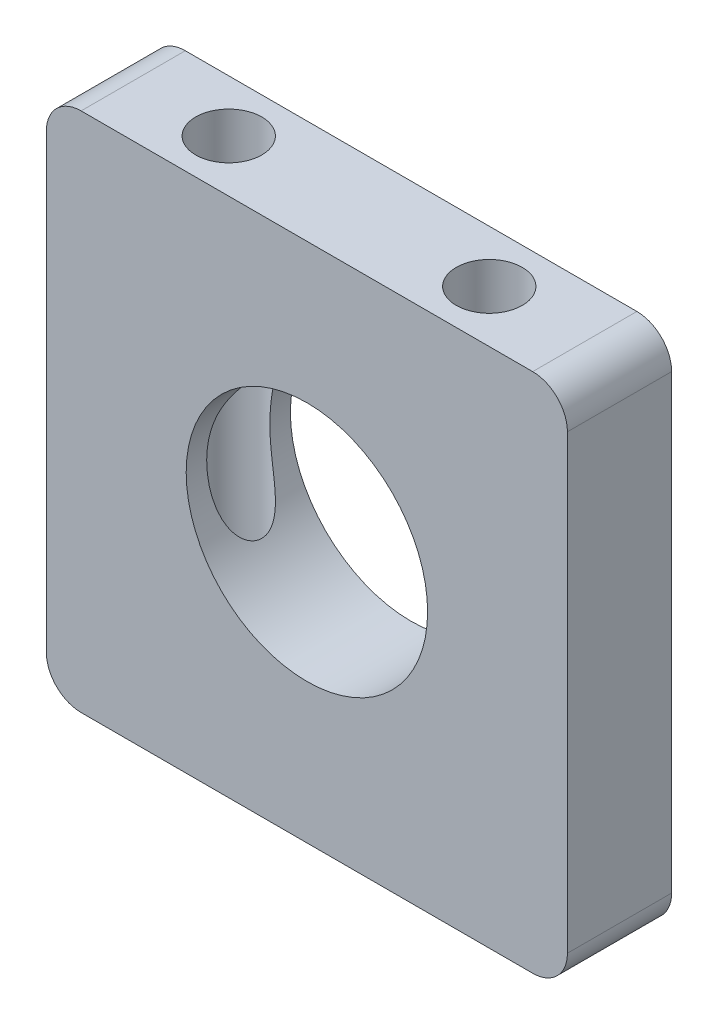
ISO-10303-21;
HEADER;
FILE_DESCRIPTION(('STEP AP214'),'2;1');
FILE_NAME('part.step','',(''),(''),'','','');
FILE_SCHEMA(('AUTOMOTIVE_DESIGN { 1 0 10303 214 1 1 1 1 }'));
ENDSEC;
DATA;
#1=APPLICATION_CONTEXT('core data for automotive mechanical design processes');
#2=APPLICATION_PROTOCOL_DEFINITION('international standard','automotive_design',2000,#1);
#3=PRODUCT_CONTEXT('',#1,'mechanical');
#4=PRODUCT('Part','Part','',(#3));
#5=PRODUCT_RELATED_PRODUCT_CATEGORY('part','',(#4));
#6=PRODUCT_DEFINITION_FORMATION('','',#4);
#7=PRODUCT_DEFINITION_CONTEXT('part definition',#1,'design');
#8=PRODUCT_DEFINITION('design','',#6,#7);
#9=PRODUCT_DEFINITION_SHAPE('','',#8);
#10=(LENGTH_UNIT() NAMED_UNIT(*) SI_UNIT(.MILLI.,.METRE.));
#11=(NAMED_UNIT(*) PLANE_ANGLE_UNIT() SI_UNIT($,.RADIAN.));
#12=(NAMED_UNIT(*) SI_UNIT($,.STERADIAN.) SOLID_ANGLE_UNIT());
#13=UNCERTAINTY_MEASURE_WITH_UNIT(LENGTH_MEASURE(1.E-05),#10,'distance_accuracy_value','');
#14=(GEOMETRIC_REPRESENTATION_CONTEXT(3) GLOBAL_UNCERTAINTY_ASSIGNED_CONTEXT((#13)) GLOBAL_UNIT_ASSIGNED_CONTEXT((#10,
#11,#12)) REPRESENTATION_CONTEXT('',''));
#15=CARTESIAN_POINT('',(0.,0.,0.));
#16=DIRECTION('',(0.,0.,1.));
#17=DIRECTION('',(1.,0.,0.));
#18=AXIS2_PLACEMENT_3D('',#15,#16,#17);
#19=CARTESIAN_POINT('',(0.,0.,7.62));
#20=DIRECTION('',(0.,0.,1.));
#21=DIRECTION('',(1.,0.,0.));
#22=AXIS2_PLACEMENT_3D('',#19,#20,#21);
#23=PLANE('',#22);
#24=DIRECTION('',(1.,0.,0.));
#25=VECTOR('',#24,1.);
#26=CARTESIAN_POINT('',(19.05,-19.05,7.62));
#27=LINE('',#26,#25);
#28=CARTESIAN_POINT('',(-16.51,-19.05,7.62));
#29=VERTEX_POINT('',#28);
#30=CARTESIAN_POINT('',(16.51,-19.05,7.62));
#31=VERTEX_POINT('',#30);
#32=EDGE_CURVE('E174',#29,#31,#27,.T.);
#33=ORIENTED_EDGE('',*,*,#32,.T.);
#34=CARTESIAN_POINT('',(16.51,-16.51,7.62));
#35=DIRECTION('',(0.,0.,1.));
#36=DIRECTION('',(1.,0.,0.));
#37=AXIS2_PLACEMENT_3D('',#34,#35,#36);
#38=CIRCLE('',#37,2.54);
#39=CARTESIAN_POINT('',(19.05,-16.51,7.62));
#40=VERTEX_POINT('',#39);
#41=EDGE_CURVE('E152',#31,#40,#38,.T.);
#42=ORIENTED_EDGE('',*,*,#41,.T.);
#43=DIRECTION('',(0.,1.,0.));
#44=VECTOR('',#43,1.);
#45=CARTESIAN_POINT('',(19.05,-19.05,7.62));
#46=LINE('',#45,#44);
#47=CARTESIAN_POINT('',(19.05,16.51,7.62));
#48=VERTEX_POINT('',#47);
#49=EDGE_CURVE('E122',#40,#48,#46,.T.);
#50=ORIENTED_EDGE('',*,*,#49,.T.);
#51=CARTESIAN_POINT('',(16.51,16.51,7.62));
#52=DIRECTION('',(0.,0.,1.));
#53=DIRECTION('',(1.,0.,0.));
#54=AXIS2_PLACEMENT_3D('',#51,#52,#53);
#55=CIRCLE('',#54,2.54);
#56=CARTESIAN_POINT('',(16.51,19.05,7.62));
#57=VERTEX_POINT('',#56);
#58=EDGE_CURVE('E58',#48,#57,#55,.T.);
#59=ORIENTED_EDGE('',*,*,#58,.T.);
#60=DIRECTION('',(-1.,0.,0.));
#61=VECTOR('',#60,1.);
#62=CARTESIAN_POINT('',(19.05,19.05,7.62));
#63=LINE('',#62,#61);
#64=CARTESIAN_POINT('',(-16.51,19.05,7.62));
#65=VERTEX_POINT('',#64);
#66=EDGE_CURVE('E138',#57,#65,#63,.T.);
#67=ORIENTED_EDGE('',*,*,#66,.T.);
#68=CARTESIAN_POINT('',(-16.51,16.51,7.62));
#69=DIRECTION('',(0.,0.,1.));
#70=DIRECTION('',(1.,0.,0.));
#71=AXIS2_PLACEMENT_3D('',#68,#69,#70);
#72=CIRCLE('',#71,2.54);
#73=CARTESIAN_POINT('',(-19.05,16.51,7.62));
#74=VERTEX_POINT('',#73);
#75=EDGE_CURVE('E148',#65,#74,#72,.T.);
#76=ORIENTED_EDGE('',*,*,#75,.T.);
#77=DIRECTION('',(0.,-1.,0.));
#78=VECTOR('',#77,1.);
#79=CARTESIAN_POINT('',(-19.05,-19.05,7.62));
#80=LINE('',#79,#78);
#81=CARTESIAN_POINT('',(-19.05,-16.51,7.62));
#82=VERTEX_POINT('',#81);
#83=EDGE_CURVE('E132',#74,#82,#80,.T.);
#84=ORIENTED_EDGE('',*,*,#83,.T.);
#85=CARTESIAN_POINT('',(-16.51,-16.51,7.62));
#86=DIRECTION('',(0.,0.,1.));
#87=DIRECTION('',(1.,0.,0.));
#88=AXIS2_PLACEMENT_3D('',#85,#86,#87);
#89=CIRCLE('',#88,2.54);
#90=EDGE_CURVE('E150',#82,#29,#89,.T.);
#91=ORIENTED_EDGE('',*,*,#90,.T.);
#92=EDGE_LOOP('',(#33,#42,#50,#59,#67,#76,#84,#91));
#93=FACE_BOUND('',#92,.T.);
#94=CARTESIAN_POINT('',(0.,0.,7.62));
#95=DIRECTION('',(0.,0.,1.));
#96=DIRECTION('',(1.,0.,0.));
#97=AXIS2_PLACEMENT_3D('',#94,#95,#96);
#98=CIRCLE('',#97,8.8265);
#99=CARTESIAN_POINT('',(8.8265,0.,7.62));
#100=VERTEX_POINT('',#99);
#101=EDGE_CURVE('E183',#100,#100,#98,.T.);
#102=ORIENTED_EDGE('',*,*,#101,.F.);
#103=EDGE_LOOP('',(#102));
#104=FACE_BOUND('',#103,.T.);
#105=ADVANCED_FACE('F38',(#93,#104),#23,.T.);
#106=CARTESIAN_POINT('',(0.,0.,0.));
#107=DIRECTION('',(0.,0.,1.));
#108=DIRECTION('',(1.,0.,0.));
#109=AXIS2_PLACEMENT_3D('',#106,#107,#108);
#110=PLANE('',#109);
#111=DIRECTION('',(0.,1.,0.));
#112=VECTOR('',#111,1.);
#113=CARTESIAN_POINT('',(19.05,-19.05,0.));
#114=LINE('',#113,#112);
#115=CARTESIAN_POINT('',(19.05,-16.51,0.));
#116=VERTEX_POINT('',#115);
#117=CARTESIAN_POINT('',(19.05,16.51,0.));
#118=VERTEX_POINT('',#117);
#119=EDGE_CURVE('E120',#116,#118,#114,.T.);
#120=ORIENTED_EDGE('',*,*,#119,.F.);
#121=CARTESIAN_POINT('',(16.51,-16.51,0.));
#122=DIRECTION('',(0.,0.,1.));
#123=DIRECTION('',(1.,0.,0.));
#124=AXIS2_PLACEMENT_3D('',#121,#122,#123);
#125=CIRCLE('',#124,2.54);
#126=CARTESIAN_POINT('',(16.51,-19.05,0.));
#127=VERTEX_POINT('',#126);
#128=EDGE_CURVE('E103',#116,#127,#125,.F.);
#129=ORIENTED_EDGE('',*,*,#128,.T.);
#130=DIRECTION('',(1.,0.,0.));
#131=VECTOR('',#130,1.);
#132=CARTESIAN_POINT('',(19.05,-19.05,0.));
#133=LINE('',#132,#131);
#134=CARTESIAN_POINT('',(-16.51,-19.05,0.));
#135=VERTEX_POINT('',#134);
#136=EDGE_CURVE('E130',#135,#127,#133,.T.);
#137=ORIENTED_EDGE('',*,*,#136,.F.);
#138=CARTESIAN_POINT('',(-16.51,-16.51,0.));
#139=DIRECTION('',(0.,0.,1.));
#140=DIRECTION('',(1.,0.,0.));
#141=AXIS2_PLACEMENT_3D('',#138,#139,#140);
#142=CIRCLE('',#141,2.54);
#143=CARTESIAN_POINT('',(-19.05,-16.51,0.));
#144=VERTEX_POINT('',#143);
#145=EDGE_CURVE('E114',#135,#144,#142,.F.);
#146=ORIENTED_EDGE('',*,*,#145,.T.);
#147=DIRECTION('',(0.,-1.,0.));
#148=VECTOR('',#147,1.);
#149=CARTESIAN_POINT('',(-19.05,-19.05,0.));
#150=LINE('',#149,#148);
#151=CARTESIAN_POINT('',(-19.05,16.51,0.));
#152=VERTEX_POINT('',#151);
#153=EDGE_CURVE('E134',#152,#144,#150,.T.);
#154=ORIENTED_EDGE('',*,*,#153,.F.);
#155=CARTESIAN_POINT('',(-16.51,16.51,0.));
#156=DIRECTION('',(0.,0.,1.));
#157=DIRECTION('',(1.,0.,0.));
#158=AXIS2_PLACEMENT_3D('',#155,#156,#157);
#159=CIRCLE('',#158,2.54);
#160=CARTESIAN_POINT('',(-16.51,19.05,0.));
#161=VERTEX_POINT('',#160);
#162=EDGE_CURVE('E141',#152,#161,#159,.F.);
#163=ORIENTED_EDGE('',*,*,#162,.T.);
#164=DIRECTION('',(-1.,0.,0.));
#165=VECTOR('',#164,1.);
#166=CARTESIAN_POINT('',(19.05,19.05,0.));
#167=LINE('',#166,#165);
#168=CARTESIAN_POINT('',(16.51,19.05,0.));
#169=VERTEX_POINT('',#168);
#170=EDGE_CURVE('E129',#169,#161,#167,.T.);
#171=ORIENTED_EDGE('',*,*,#170,.F.);
#172=CARTESIAN_POINT('',(16.51,16.51,0.));
#173=DIRECTION('',(0.,0.,1.));
#174=DIRECTION('',(1.,0.,0.));
#175=AXIS2_PLACEMENT_3D('',#172,#173,#174);
#176=CIRCLE('',#175,2.54);
#177=EDGE_CURVE('E123',#169,#118,#176,.F.);
#178=ORIENTED_EDGE('',*,*,#177,.T.);
#179=EDGE_LOOP('',(#120,#129,#137,#146,#154,#163,#171,#178));
#180=FACE_BOUND('',#179,.T.);
#181=CARTESIAN_POINT('',(0.,0.,0.));
#182=DIRECTION('',(0.,0.,1.));
#183=DIRECTION('',(1.,0.,0.));
#184=AXIS2_PLACEMENT_3D('',#181,#182,#183);
#185=CIRCLE('',#184,8.8265);
#186=CARTESIAN_POINT('',(8.8265,0.,0.));
#187=VERTEX_POINT('',#186);
#188=EDGE_CURVE('E179',#187,#187,#185,.T.);
#189=ORIENTED_EDGE('',*,*,#188,.T.);
#190=EDGE_LOOP('',(#189));
#191=FACE_BOUND('',#190,.T.);
#192=ADVANCED_FACE('F126',(#180,#191),#110,.F.);
#193=CARTESIAN_POINT('',(-19.05,-19.05,7.62));
#194=DIRECTION('',(1.,0.,0.));
#195=DIRECTION('',(0.,0.,-1.));
#196=AXIS2_PLACEMENT_3D('',#193,#194,#195);
#197=PLANE('',#196);
#198=ORIENTED_EDGE('',*,*,#153,.T.);
#199=DIRECTION('',(0.,0.,-1.));
#200=VECTOR('',#199,1.);
#201=CARTESIAN_POINT('',(-19.05,-16.51,7.62));
#202=LINE('',#201,#200);
#203=EDGE_CURVE('E157',#144,#82,#202,.F.);
#204=ORIENTED_EDGE('',*,*,#203,.T.);
#205=ORIENTED_EDGE('',*,*,#83,.F.);
#206=DIRECTION('',(0.,0.,-1.));
#207=VECTOR('',#206,1.);
#208=CARTESIAN_POINT('',(-19.05,16.51,7.62));
#209=LINE('',#208,#207);
#210=EDGE_CURVE('E154',#74,#152,#209,.T.);
#211=ORIENTED_EDGE('',*,*,#210,.T.);
#212=EDGE_LOOP('',(#198,#204,#205,#211));
#213=FACE_BOUND('',#212,.T.);
#214=ADVANCED_FACE('F170',(#213),#197,.F.);
#215=CARTESIAN_POINT('',(19.05,-19.05,7.62));
#216=DIRECTION('',(0.,1.,0.));
#217=DIRECTION('',(-1.,0.,0.));
#218=AXIS2_PLACEMENT_3D('',#215,#216,#217);
#219=PLANE('',#218);
#220=CARTESIAN_POINT('',(9.525,-19.05,3.81));
#221=DIRECTION('',(0.,-1.,0.));
#222=DIRECTION('',(1.,0.,0.));
#223=AXIS2_PLACEMENT_3D('',#220,#221,#222);
#224=CIRCLE('',#223,2.413);
#225=CARTESIAN_POINT('',(11.938,-19.05,3.81));
#226=VERTEX_POINT('',#225);
#227=EDGE_CURVE('E188',#226,#226,#224,.T.);
#228=ORIENTED_EDGE('',*,*,#227,.F.);
#229=EDGE_LOOP('',(#228));
#230=FACE_BOUND('',#229,.T.);
#231=CARTESIAN_POINT('',(-9.525,-19.05,3.81));
#232=DIRECTION('',(0.,-1.,0.));
#233=DIRECTION('',(1.,0.,0.));
#234=AXIS2_PLACEMENT_3D('',#231,#232,#233);
#235=CIRCLE('',#234,2.413);
#236=CARTESIAN_POINT('',(-7.112,-19.05,3.81));
#237=VERTEX_POINT('',#236);
#238=EDGE_CURVE('E190',#237,#237,#235,.T.);
#239=ORIENTED_EDGE('',*,*,#238,.F.);
#240=EDGE_LOOP('',(#239));
#241=FACE_BOUND('',#240,.T.);
#242=ORIENTED_EDGE('',*,*,#136,.T.);
#243=DIRECTION('',(0.,0.,-1.));
#244=VECTOR('',#243,1.);
#245=CARTESIAN_POINT('',(16.51,-19.05,7.62));
#246=LINE('',#245,#244);
#247=EDGE_CURVE('E108',#127,#31,#246,.F.);
#248=ORIENTED_EDGE('',*,*,#247,.T.);
#249=ORIENTED_EDGE('',*,*,#32,.F.);
#250=DIRECTION('',(0.,0.,-1.));
#251=VECTOR('',#250,1.);
#252=CARTESIAN_POINT('',(-16.51,-19.05,7.62));
#253=LINE('',#252,#251);
#254=EDGE_CURVE('E113',#29,#135,#253,.T.);
#255=ORIENTED_EDGE('',*,*,#254,.T.);
#256=EDGE_LOOP('',(#242,#248,#249,#255));
#257=FACE_BOUND('',#256,.T.);
#258=ADVANCED_FACE('F243',(#230,#241,#257),#219,.F.);
#259=CARTESIAN_POINT('',(19.05,-19.05,7.62));
#260=DIRECTION('',(-1.,0.,0.));
#261=DIRECTION('',(0.,0.,1.));
#262=AXIS2_PLACEMENT_3D('',#259,#260,#261);
#263=PLANE('',#262);
#264=ORIENTED_EDGE('',*,*,#49,.F.);
#265=DIRECTION('',(0.,0.,-1.));
#266=VECTOR('',#265,1.);
#267=CARTESIAN_POINT('',(19.05,-16.51,7.62));
#268=LINE('',#267,#266);
#269=EDGE_CURVE('E107',#40,#116,#268,.T.);
#270=ORIENTED_EDGE('',*,*,#269,.T.);
#271=ORIENTED_EDGE('',*,*,#119,.T.);
#272=DIRECTION('',(0.,0.,-1.));
#273=VECTOR('',#272,1.);
#274=CARTESIAN_POINT('',(19.05,16.51,7.62));
#275=LINE('',#274,#273);
#276=EDGE_CURVE('E124',#118,#48,#275,.F.);
#277=ORIENTED_EDGE('',*,*,#276,.T.);
#278=EDGE_LOOP('',(#264,#270,#271,#277));
#279=FACE_BOUND('',#278,.T.);
#280=ADVANCED_FACE('F119',(#279),#263,.F.);
#281=CARTESIAN_POINT('',(19.05,19.05,7.62));
#282=DIRECTION('',(0.,-1.,0.));
#283=DIRECTION('',(1.,0.,0.));
#284=AXIS2_PLACEMENT_3D('',#281,#282,#283);
#285=PLANE('',#284);
#286=CARTESIAN_POINT('',(-9.525,19.05,3.81));
#287=DIRECTION('',(0.,1.,0.));
#288=DIRECTION('',(-1.,0.,0.));
#289=AXIS2_PLACEMENT_3D('',#286,#287,#288);
#290=CIRCLE('',#289,2.413);
#291=CARTESIAN_POINT('',(-11.938,19.05,3.81));
#292=VERTEX_POINT('',#291);
#293=EDGE_CURVE('E193',#292,#292,#290,.T.);
#294=ORIENTED_EDGE('',*,*,#293,.F.);
#295=EDGE_LOOP('',(#294));
#296=FACE_BOUND('',#295,.T.);
#297=CARTESIAN_POINT('',(9.525,19.05,3.81));
#298=DIRECTION('',(0.,1.,0.));
#299=DIRECTION('',(-1.,0.,0.));
#300=AXIS2_PLACEMENT_3D('',#297,#298,#299);
#301=CIRCLE('',#300,2.413);
#302=CARTESIAN_POINT('',(7.112,19.05,3.81));
#303=VERTEX_POINT('',#302);
#304=EDGE_CURVE('E196',#303,#303,#301,.T.);
#305=ORIENTED_EDGE('',*,*,#304,.F.);
#306=EDGE_LOOP('',(#305));
#307=FACE_BOUND('',#306,.T.);
#308=ORIENTED_EDGE('',*,*,#170,.T.);
#309=DIRECTION('',(0.,0.,-1.));
#310=VECTOR('',#309,1.);
#311=CARTESIAN_POINT('',(-16.51,19.05,7.62));
#312=LINE('',#311,#310);
#313=EDGE_CURVE('E11',#161,#65,#312,.F.);
#314=ORIENTED_EDGE('',*,*,#313,.T.);
#315=ORIENTED_EDGE('',*,*,#66,.F.);
#316=DIRECTION('',(0.,0.,-1.));
#317=VECTOR('',#316,1.);
#318=CARTESIAN_POINT('',(16.51,19.05,7.62));
#319=LINE('',#318,#317);
#320=EDGE_CURVE('E46',#57,#169,#319,.T.);
#321=ORIENTED_EDGE('',*,*,#320,.T.);
#322=EDGE_LOOP('',(#308,#314,#315,#321));
#323=FACE_BOUND('',#322,.T.);
#324=ADVANCED_FACE('F160',(#296,#307,#323),#285,.F.);
#325=CARTESIAN_POINT('',(0.,0.,7.62));
#326=DIRECTION('',(0.,0.,-1.));
#327=DIRECTION('',(-1.,0.,0.));
#328=AXIS2_PLACEMENT_3D('',#325,#326,#327);
#329=CYLINDRICAL_SURFACE('',#328,8.8265);
#330=CARTESIAN_POINT('',(7.112,-5.22748106165865,3.81));
#331=CARTESIAN_POINT('',(7.11200801079814,-5.22747300955538,3.9030672297396));
#332=CARTESIAN_POINT('',(7.11745006339892,-5.22009103076612,3.99630652009354));
#333=CARTESIAN_POINT('',(7.13865510247261,-5.19105080802399,4.17943494363403));
#334=CARTESIAN_POINT('',(7.15444600180276,-5.16935395299357,4.26931431946948));
#335=CARTESIAN_POINT('',(7.1945975987547,-5.11331871029749,4.44214586214466));
#336=CARTESIAN_POINT('',(7.21889217918834,-5.07907776138608,4.52514553144723));
#337=CARTESIAN_POINT('',(7.27402184084216,-4.99980373509525,4.68332649330547));
#338=CARTESIAN_POINT('',(7.30485708926352,-4.95477038182233,4.75850758591912));
#339=CARTESIAN_POINT('',(7.38367609311725,-4.83685306073568,4.92759491391936));
#340=CARTESIAN_POINT('',(7.43371240449293,-4.75990014444413,5.01769206491304));
#341=CARTESIAN_POINT('',(7.5378564826724,-4.59320277096938,5.18236139419303));
#342=CARTESIAN_POINT('',(7.59197271071986,-4.50343136507206,5.25690002932834));
#343=CARTESIAN_POINT('',(7.68860972081786,-4.33584429807193,5.3767618008045));
#344=CARTESIAN_POINT('',(7.73099177109867,-4.25990125841613,5.42488214535389));
#345=CARTESIAN_POINT('',(7.81515362907748,-4.10345764776672,5.51374391777611));
#346=CARTESIAN_POINT('',(7.85693308347699,-4.02295452943619,5.55448116689365));
#347=CARTESIAN_POINT('',(7.93913525581443,-3.85820236859984,5.6295340904718));
#348=CARTESIAN_POINT('',(7.97955587172541,-3.77394795243486,5.66384016053239));
#349=CARTESIAN_POINT('',(8.05843125325966,-3.60245889566426,5.72684338987061));
#350=CARTESIAN_POINT('',(8.09688528316701,-3.51522315979069,5.75553846120012));
#351=CARTESIAN_POINT('',(8.19854142820529,-3.27390914216966,5.82725464496647));
#352=CARTESIAN_POINT('',(8.25937954792695,-3.11740415006639,5.86549667619405));
#353=CARTESIAN_POINT('',(8.37261243954521,-2.79911945958914,5.93104653927953));
#354=CARTESIAN_POINT('',(8.42500121656131,-2.63733611317506,5.95834662795413));
#355=CARTESIAN_POINT('',(8.52066835130171,-2.30965205873508,6.0047017757217));
#356=CARTESIAN_POINT('',(8.5639306405223,-2.14374465422905,6.02374235397012));
#357=CARTESIAN_POINT('',(8.6408166293954,-1.80911258941824,6.05555337047227));
#358=CARTESIAN_POINT('',(8.67443817393846,-1.64038730810677,6.06832240722837));
#359=CARTESIAN_POINT('',(8.74213279935605,-1.23976907421071,6.09285847623068));
#360=CARTESIAN_POINT('',(8.77199925862041,-1.00703159884214,6.10260484605242));
#361=CARTESIAN_POINT('',(8.81311048854332,-0.539682404066879,6.11569620335264));
#362=CARTESIAN_POINT('',(8.82434809903276,-0.305069998811009,6.11903872953183));
#363=CARTESIAN_POINT('',(8.82809095702108,0.16434198856395,6.12017109552819));
#364=CARTESIAN_POINT('',(8.82059420036036,0.39914158802246,6.11796034126803));
#365=CARTESIAN_POINT('',(8.7869265538363,0.867200353736336,6.10742016643486));
#366=CARTESIAN_POINT('',(8.76076269780756,1.10046006682457,6.09909305049553));
#367=CARTESIAN_POINT('',(8.69939553960829,1.50244405713452,6.07752788236942));
#368=CARTESIAN_POINT('',(8.66841184401029,1.67192356778129,6.06617062459568));
#369=CARTESIAN_POINT('',(8.59670762484014,2.00830179657323,6.03763105323173));
#370=CARTESIAN_POINT('',(8.55598911150654,2.17520103997756,6.02044994196084));
#371=CARTESIAN_POINT('',(8.46528080925571,2.50505317847193,5.97842323126903));
#372=CARTESIAN_POINT('',(8.41531473521015,2.66801498883356,5.95359713126773));
#373=CARTESIAN_POINT('',(8.30671486836645,2.98902796171199,5.89379329659095));
#374=CARTESIAN_POINT('',(8.24808692195613,3.1470823501189,5.8588223939954));
#375=CARTESIAN_POINT('',(8.12051925553573,3.46330214880813,5.7737099204325));
#376=CARTESIAN_POINT('',(8.05124640930059,3.62118485353996,5.72298499152574));
#377=CARTESIAN_POINT('',(7.94291524089051,3.85024386856684,5.63257165522813));
#378=CARTESIAN_POINT('',(7.90606375060776,3.92531020314923,5.60004203502554));
#379=CARTESIAN_POINT('',(7.83135995174388,4.07230845583826,5.52953262172186));
#380=CARTESIAN_POINT('',(7.79350786129736,4.14424104820425,5.49155400865767));
#381=CARTESIAN_POINT('',(7.69593815245045,4.32378357590118,5.38631984851432));
#382=CARTESIAN_POINT('',(7.63590201297114,4.4286929219027,5.31461542380668));
#383=CARTESIAN_POINT('',(7.51823630741705,4.62561549821409,5.15363631198799));
#384=CARTESIAN_POINT('',(7.46060207748125,4.71765462479875,5.0643978021338));
#385=CARTESIAN_POINT('',(7.3683075419553,4.86006002745423,4.89520237819679));
#386=CARTESIAN_POINT('',(7.3318068986622,4.91479871341166,4.81995658230632));
#387=CARTESIAN_POINT('',(7.26496636333918,5.01307212302397,4.65989492597317));
#388=CARTESIAN_POINT('',(7.23462404805187,5.05661125543217,4.57508285030986));
#389=CARTESIAN_POINT('',(7.18243182875338,5.13048399052183,4.39625179024768));
#390=CARTESIAN_POINT('',(7.1606712967228,5.16067899721653,4.3021480537806));
#391=CARTESIAN_POINT('',(7.12851440028009,5.20501350463715,4.10837282822847));
#392=CARTESIAN_POINT('',(7.11810477579197,5.21917174019378,4.00870797905444));
#393=CARTESIAN_POINT('',(7.11052885982475,5.22948371264671,3.82325216677152));
#394=CARTESIAN_POINT('',(7.11158823401923,5.22804953849425,3.73765805104472));
#395=CARTESIAN_POINT('',(7.12264962396727,5.21296964557485,3.56815889111249));
#396=CARTESIAN_POINT('',(7.13265018881398,5.19932590808051,3.48425357512048));
#397=CARTESIAN_POINT('',(7.16002983666261,5.16154806225807,3.32445317928279));
#398=CARTESIAN_POINT('',(7.17703796389667,5.13794007581426,3.24836693970078));
#399=CARTESIAN_POINT('',(7.21711776266923,5.0814870080408,3.10144011927015));
#400=CARTESIAN_POINT('',(7.24019130196137,5.04863908118988,3.03060116287213));
#401=CARTESIAN_POINT('',(7.30125708183351,4.96010689965093,2.86774712695388));
#402=CARTESIAN_POINT('',(7.34151592997976,4.90055270308401,2.77868611103498));
#403=CARTESIAN_POINT('',(7.42759319637689,4.76908144895804,2.61325430134165));
#404=CARTESIAN_POINT('',(7.47342293325163,4.69713909406129,2.53691011634232));
#405=CARTESIAN_POINT('',(7.55508110704635,4.56423405940081,2.41506559409516));
#406=CARTESIAN_POINT('',(7.59033201354374,4.50543192720093,2.36675931029214));
#407=CARTESIAN_POINT('',(7.6613325571251,4.38361396297353,2.2761743547652));
#408=CARTESIAN_POINT('',(7.69708242637281,4.32059611391491,2.23389859911847));
#409=CARTESIAN_POINT('',(7.80405590183839,4.12620663931901,2.11520722928784));
#410=CARTESIAN_POINT('',(7.87494238389388,3.98959675814357,2.04701283681415));
#411=CARTESIAN_POINT('',(8.00128391053103,3.72884798090472,1.93737970521777));
#412=CARTESIAN_POINT('',(8.05743138950969,3.60604159620615,1.893435347286));
#413=CARTESIAN_POINT('',(8.16506300191149,3.35521437529458,1.8156200055499));
#414=CARTESIAN_POINT('',(8.21654388624672,3.22718999463251,1.78175600323039));
#415=CARTESIAN_POINT('',(8.31404018169202,2.96701693593067,1.72207838210069));
#416=CARTESIAN_POINT('',(8.36004566528364,2.83486129898889,1.69627925214377));
#417=CARTESIAN_POINT('',(8.44599357746109,2.56749503698585,1.65114352627329));
#418=CARTESIAN_POINT('',(8.48593418868845,2.4322835101064,1.63180886538092));
#419=CARTESIAN_POINT('',(8.58039765918767,2.08160646898726,1.58865721841114));
#420=CARTESIAN_POINT('',(8.6302242535648,1.86440150892112,1.56858497299655));
#421=CARTESIAN_POINT('',(8.71337438311501,1.42619044304737,1.53716311036081));
#422=CARTESIAN_POINT('',(8.74668938900417,1.20518243358587,1.52581799959188));
#423=CARTESIAN_POINT('',(8.79650942077131,0.760672252957275,1.50944360252643));
#424=CARTESIAN_POINT('',(8.81298566904717,0.537166469690534,1.50442512510267));
#425=CARTESIAN_POINT('',(8.82888603106338,0.0895487112811985,1.49957544945694));
#426=CARTESIAN_POINT('',(8.82831399028827,-0.134563115755585,1.49974308143441));
#427=CARTESIAN_POINT('',(8.8099387553858,-0.586874939764453,1.50536301166863));
#428=CARTESIAN_POINT('',(8.79176267168413,-0.81505836565834,1.51092967604014));
#429=CARTESIAN_POINT('',(8.73776126727406,-1.2692159566235,1.52884887053123));
#430=CARTESIAN_POINT('',(8.7019282561096,-1.49518911523819,1.54120435778551));
#431=CARTESIAN_POINT('',(8.63534935239369,-1.83051372935022,1.56687002276559));
#432=CARTESIAN_POINT('',(8.61107961894315,-1.94146374495876,1.57658738697392));
#433=CARTESIAN_POINT('',(8.55835374385892,-2.16206729586719,1.59889406528424));
#434=CARTESIAN_POINT('',(8.52989823501917,-2.27172102443382,1.61148294543652));
#435=CARTESIAN_POINT('',(8.46894581033314,-2.48934084627888,1.64010369810335));
#436=CARTESIAN_POINT('',(8.4364525189571,-2.59730835654801,1.65613249208238));
#437=CARTESIAN_POINT('',(8.36758412738009,-2.81127384142546,1.69234264985676));
#438=CARTESIAN_POINT('',(8.33121005126755,-2.91727232700753,1.71252291943019));
#439=CARTESIAN_POINT('',(8.26299732839584,-3.10445975958024,1.75302765462885));
#440=CARTESIAN_POINT('',(8.23185168468993,-3.1861077432458,1.77239883988701));
#441=CARTESIAN_POINT('',(8.16749176476715,-3.34764641707366,1.8146994937066));
#442=CARTESIAN_POINT('',(8.13427771440964,-3.4275372978179,1.83762857417062));
#443=CARTESIAN_POINT('',(8.06595712751096,-3.58536510289984,1.88761667755942));
#444=CARTESIAN_POINT('',(8.0308476418086,-3.66329868870159,1.91468226380045));
#445=CARTESIAN_POINT('',(7.9591036222997,-3.81666572107733,1.973511506775));
#446=CARTESIAN_POINT('',(7.92246908331402,-3.89209915915918,2.00527517946432));
#447=CARTESIAN_POINT('',(7.84760121525959,-4.04095151295898,2.0746206355606));
#448=CARTESIAN_POINT('',(7.80935292387184,-4.1143291147714,2.11227562667819));
#449=CARTESIAN_POINT('',(7.73233310260597,-4.25731376189064,2.19381292849721));
#450=CARTESIAN_POINT('',(7.6935614392074,-4.32691982140809,2.23769685654569));
#451=CARTESIAN_POINT('',(7.61646667073028,-4.46122266591766,2.33223981287751));
#452=CARTESIAN_POINT('',(7.57814244536536,-4.5259364313798,2.38287354522346));
#453=CARTESIAN_POINT('',(7.50291727164956,-4.64957700473765,2.49162303373021));
#454=CARTESIAN_POINT('',(7.46601496433771,-4.70850942571472,2.54973140350246));
#455=CARTESIAN_POINT('',(7.39156253884922,-4.82463477371872,2.67988892437756));
#456=CARTESIAN_POINT('',(7.3542886592708,-4.88112096206216,2.75274013950501));
#457=CARTESIAN_POINT('',(7.28530333055292,-4.98350043962659,2.90803113687255));
#458=CARTESIAN_POINT('',(7.25359281621395,-5.02939194905453,2.99047252666654));
#459=CARTESIAN_POINT('',(7.19798862958908,-5.10866524247668,3.16500614687056));
#460=CARTESIAN_POINT('',(7.17418392256116,-5.14190522737732,3.25719377118488));
#461=CARTESIAN_POINT('',(7.14660515971969,-5.18009416706716,3.39991545905339));
#462=CARTESIAN_POINT('',(7.13877032364369,-5.19087422183113,3.44818447048929));
#463=CARTESIAN_POINT('',(7.12600246937045,-5.20838854830386,3.54581505687472));
#464=CARTESIAN_POINT('',(7.12106714479755,-5.21512603570707,3.59517573095543));
#465=CARTESIAN_POINT('',(7.11577918030006,-5.22233647376985,3.67223088477446));
#466=CARTESIAN_POINT('',(7.11436405607167,-5.22426366923365,3.69972759803358));
#467=CARTESIAN_POINT('',(7.11247322877179,-5.22683722434251,3.75481115659372));
#468=CARTESIAN_POINT('',(7.11199762414802,-5.22748344976096,3.78239801103686));
#469=CARTESIAN_POINT('',(7.112,-5.22748106165865,3.81));
#470=B_SPLINE_CURVE_WITH_KNOTS('',3,(#330,#331,#332,#333,#334,#335,#336,#337,#338,#339,#340,
#341,#342,#343,#344,#345,#346,#347,#348,#349,#350,#351,#352,#353,#354,#355,#356,#357,#358,#359,
#360,#361,#362,#363,#364,#365,#366,#367,#368,#369,#370,#371,#372,#373,#374,#375,#376,#377,#378,
#379,#380,#381,#382,#383,#384,#385,#386,#387,#388,#389,#390,#391,#392,#393,#394,#395,#396,#397,
#398,#399,#400,#401,#402,#403,#404,#405,#406,#407,#408,#409,#410,#411,#412,#413,#414,#415,#416,
#417,#418,#419,#420,#421,#422,#423,#424,#425,#426,#427,#428,#429,#430,#431,#432,#433,#434,#435,
#436,#437,#438,#439,#440,#441,#442,#443,#444,#445,#446,#447,#448,#449,#450,#451,#452,#453,#454,
#455,#456,#457,#458,#459,#460,#461,#462,#463,#464,#465,#466,#467,#468,#469),.UNSPECIFIED.,.T.,
.F.,(4,2,2,2,2,2,2,2,2,2,2,2,2,2,2,2,2,2,2,2,2,2,2,2,2,2,2,2,2,2,2,2,2,2,2,2,2,2,2,2,2,2,2,2,2,
2,2,2,2,2,2,2,2,2,2,2,2,2,2,2,2,2,2,2,2,2,2,2,2,4),(0.,0.279069458955362,0.55889473769484,
0.836590973608862,1.11429430921603,1.49801833719957,1.88256129402263,2.180339380468,
2.47828548343557,2.7766730584672,3.07517145816856,3.59098224272549,4.10715740456639,
4.62423391952498,5.14142593274866,5.84506427804118,6.5489730105396,7.25295704880151,
7.95667596317752,8.47431526420308,8.99184776497035,9.50807102267847,10.0239474305448,
10.5618235034241,10.8308182548553,11.0997548403163,11.5200227593813,11.9394324962845,
12.2382274495442,12.5369046002334,12.838614900099,13.1399723645834,13.3954681187199,
13.6509224205167,13.8943066937968,14.1377660016255,14.4792251471773,14.8213900253384,
15.0726546358045,15.32404033701,15.8272366218506,16.2527167240454,16.6784908246235,
17.1050255061983,17.5316877491021,18.2019803435139,18.8726188266689,19.5444015306281,
20.2160327055725,20.9022087250199,21.588683872225,21.9305522625059,22.272369023084,
22.6138811425417,22.9553033632757,23.2237294256681,23.4921262285371,23.7609533996614,
24.0297814838067,24.3022632648958,24.5748159258992,24.8463744542888,25.1176666627344,
25.4149327259917,25.7122486904984,26.0128051947085,26.1628166743044,26.3127086672526,
26.3954667457759,26.4782334956575),.UNSPECIFIED.);
#471=CARTESIAN_POINT('',(7.112,-5.22748106165865,3.81));
#472=VERTEX_POINT('',#471);
#473=EDGE_CURVE('E199',#472,#472,#470,.T.);
#474=ORIENTED_EDGE('',*,*,#473,.F.);
#475=EDGE_LOOP('',(#474));
#476=FACE_BOUND('',#475,.T.);
#477=CARTESIAN_POINT('',(-8.8265,0.,6.1196897518931));
#478=CARTESIAN_POINT('',(-8.82650092603533,-0.204315636438204,6.1196866895291));
#479=CARTESIAN_POINT('',(-8.81940289139985,-0.408619186177959,6.1175779911619));
#480=CARTESIAN_POINT('',(-8.79105616660927,-0.816183150386737,6.10872181238477));
#481=CARTESIAN_POINT('',(-8.76980559431162,-1.01944342248693,6.10197371497843));
#482=CARTESIAN_POINT('',(-8.71336848012611,-1.4233077795708,6.08259992639713));
#483=CARTESIAN_POINT('',(-8.6782111586325,-1.62391652830382,6.06998654945617));
#484=CARTESIAN_POINT('',(-8.5942792993427,-2.02155771082447,6.03674230499844));
#485=CARTESIAN_POINT('',(-8.5455111801531,-2.21859178383315,6.01611521481109));
#486=CARTESIAN_POINT('',(-8.45857516287716,-2.52449307224613,5.97483683757558));
#487=CARTESIAN_POINT('',(-8.42475730743351,-2.63512249488426,5.95794798820488));
#488=CARTESIAN_POINT('',(-8.35305709543693,-2.85426297779103,5.91968616821279));
#489=CARTESIAN_POINT('',(-8.31517554573674,-2.96277445354275,5.89831408694174));
#490=CARTESIAN_POINT('',(-8.23563630915024,-3.17717961339194,5.85016439979778));
#491=CARTESIAN_POINT('',(-8.19397909233373,-3.28307362128007,5.82338746631995));
#492=CARTESIAN_POINT('',(-8.10731424545524,-3.49160308850892,5.76333507045181));
#493=CARTESIAN_POINT('',(-8.06230742804973,-3.59423932966189,5.73006118114708));
#494=CARTESIAN_POINT('',(-7.98107182151055,-3.77048325831746,5.66495233766081));
#495=CARTESIAN_POINT('',(-7.94543033186359,-3.84498370207006,5.63480272292887));
#496=CARTESIAN_POINT('',(-7.87300708102979,-3.99117905896332,5.56950742617441));
#497=CARTESIAN_POINT('',(-7.83622564816773,-4.06287476670599,5.53436317243424));
#498=CARTESIAN_POINT('',(-7.76207945027831,-4.20279442231082,5.45848107437561));
#499=CARTESIAN_POINT('',(-7.72471560096717,-4.27102321822346,5.4177513531412));
#500=CARTESIAN_POINT('',(-7.65006486695746,-4.40333753977941,5.33003338896786));
#501=CARTESIAN_POINT('',(-7.61277795298033,-4.46742513416613,5.28304830737116));
#502=CARTESIAN_POINT('',(-7.52799441160133,-4.60924154782741,5.16689435083819));
#503=CARTESIAN_POINT('',(-7.48082162455708,-4.6852318259123,5.09531445516103));
#504=CARTESIAN_POINT('',(-7.39078698869825,-4.82600711899307,4.93949847760675));
#505=CARTESIAN_POINT('',(-7.34791952005503,-4.89080682298167,4.85527926216122));
#506=CARTESIAN_POINT('',(-7.27728404863442,-4.99514235499897,4.6913240396151));
#507=CARTESIAN_POINT('',(-7.24819310645608,-5.03713804683809,4.61373882862738));
#508=CARTESIAN_POINT('',(-7.19718730311795,-5.10975279798311,4.45116755058227));
#509=CARTESIAN_POINT('',(-7.17526895047286,-5.14037739351109,4.366185109943));
#510=CARTESIAN_POINT('',(-7.14042454194009,-5.18867528056483,4.19009377307293));
#511=CARTESIAN_POINT('',(-7.12756506295984,-5.2062527335409,4.09894480572619));
#512=CARTESIAN_POINT('',(-7.11247148105534,-5.22685649663257,3.91415514735062));
#513=CARTESIAN_POINT('',(-7.11023122265513,-5.22989123650429,3.82051593147014));
#514=CARTESIAN_POINT('',(-7.11621075764554,-5.22174799563154,3.64558645683456));
#515=CARTESIAN_POINT('',(-7.1232024395443,-5.21223886026637,3.56416802411195));
#516=CARTESIAN_POINT('',(-7.14495964361276,-5.18237319576584,3.40444719136877));
#517=CARTESIAN_POINT('',(-7.15972517656325,-5.16201665158725,3.32614479566969));
#518=CARTESIAN_POINT('',(-7.19614510759594,-5.11112294744473,3.17339833195105));
#519=CARTESIAN_POINT('',(-7.2178923523062,-5.08044829274692,3.09902297156456));
#520=CARTESIAN_POINT('',(-7.26674012169633,-5.01033121624421,2.95646580683751));
#521=CARTESIAN_POINT('',(-7.2938429867537,-4.97088496034858,2.8882867293235));
#522=CARTESIAN_POINT('',(-7.36662477960557,-4.86271826772021,2.72582870716862));
#523=CARTESIAN_POINT('',(-7.41476592319948,-4.78928230747711,2.63578965228163));
#524=CARTESIAN_POINT('',(-7.51546632147417,-4.62966530908847,2.47068893730436));
#525=CARTESIAN_POINT('',(-7.56803589605476,-4.54345412431584,2.39566371849761));
#526=CARTESIAN_POINT('',(-7.66182398490994,-4.38293171498913,2.27523101658466));
#527=CARTESIAN_POINT('',(-7.70281937169487,-4.31055814506553,2.22700138610709));
#528=CARTESIAN_POINT('',(-7.78445634463192,-4.16131885375443,2.13765351972267));
#529=CARTESIAN_POINT('',(-7.82509772250298,-4.0844506693167,2.09653923282726));
#530=CARTESIAN_POINT('',(-7.90527941619962,-3.9270188692744,2.02055053925754));
#531=CARTESIAN_POINT('',(-7.94481819745573,-3.84645047972391,1.9856844952477));
#532=CARTESIAN_POINT('',(-8.02219660194649,-3.68235071336057,1.92143545689522));
#533=CARTESIAN_POINT('',(-8.06003558791272,-3.5988182459527,1.89205450614806));
#534=CARTESIAN_POINT('',(-8.16027051535745,-3.36785430407424,1.81844084101486));
#535=CARTESIAN_POINT('',(-8.22057553096306,-3.21801337867769,1.77888908873782));
#536=CARTESIAN_POINT('',(-8.33353162848398,-2.91305057821811,1.7106393994284));
#537=CARTESIAN_POINT('',(-8.38617725473424,-2.75792503512754,1.68194917581712));
#538=CARTESIAN_POINT('',(-8.48312735512279,-2.44351429050873,1.63283960741864));
#539=CARTESIAN_POINT('',(-8.52741640790459,-2.2842220044116,1.61243547551987));
#540=CARTESIAN_POINT('',(-8.60710088581817,-1.96274469222697,1.57798192592485));
#541=CARTESIAN_POINT('',(-8.64249417731864,-1.80055898212817,1.56393403211484));
#542=CARTESIAN_POINT('',(-8.71653324857991,-1.40834050813404,1.53599032858135));
#543=CARTESIAN_POINT('',(-8.75074669772154,-1.17729310230209,1.5244349950518));
#544=CARTESIAN_POINT('',(-8.80076305810582,-0.712922314962261,1.50810350871593));
#545=CARTESIAN_POINT('',(-8.81655849825768,-0.479598048538348,1.50333010676446));
#546=CARTESIAN_POINT('',(-8.82958665377427,-0.0123066969427934,1.49936899705931));
#547=CARTESIAN_POINT('',(-8.82681305833774,0.221660579753646,1.50018318828598));
#548=CARTESIAN_POINT('',(-8.80270885570831,0.688485616568009,1.50760280917384));
#549=CARTESIAN_POINT('',(-8.78138465837453,0.921343731997141,1.51420623846401));
#550=CARTESIAN_POINT('',(-8.72722649992655,1.33246793069026,1.53256070741205));
#551=CARTESIAN_POINT('',(-8.6980369595742,1.51128753915735,1.54282878390513));
#552=CARTESIAN_POINT('',(-8.6288057478055,1.86642334117727,1.56928868090154));
#553=CARTESIAN_POINT('',(-8.58876242794279,2.04273915017468,1.5854814013566));
#554=CARTESIAN_POINT('',(-8.49831118073384,2.39125733760782,1.62575505492742));
#555=CARTESIAN_POINT('',(-8.44793372582019,2.56347018500572,1.64981291706169));
#556=CARTESIAN_POINT('',(-8.3374290435213,2.90279048594678,1.70853315449896));
#557=CARTESIAN_POINT('',(-8.27730899373564,3.06990159116642,1.74318773949059));
#558=CARTESIAN_POINT('',(-8.14860785795454,3.39675639188279,1.82656985354204));
#559=CARTESIAN_POINT('',(-8.08005447884137,3.55652196321886,1.87525196856396));
#560=CARTESIAN_POINT('',(-7.97244920900034,3.78873009643874,1.96222782394761));
#561=CARTESIAN_POINT('',(-7.93577817560524,3.86490527820151,1.99355183577699));
#562=CARTESIAN_POINT('',(-7.86128834262401,4.01425066768344,2.06152183081187));
#563=CARTESIAN_POINT('',(-7.82346975375188,4.08742142133809,2.09816684159813));
#564=CARTESIAN_POINT('',(-7.72394283271079,4.27372427921032,2.20169661336638));
#565=CARTESIAN_POINT('',(-7.66173504197336,4.38400378047163,2.27339137104255));
#566=CARTESIAN_POINT('',(-7.539303751814,4.59134183152244,2.43529040344945));
#567=CARTESIAN_POINT('',(-7.47907648319898,4.68842674646515,2.52545683627202));
#568=CARTESIAN_POINT('',(-7.38321258242287,4.83741862158664,2.69567049904623));
#569=CARTESIAN_POINT('',(-7.34566872852658,4.89408475213247,2.77045234797356));
#570=CARTESIAN_POINT('',(-7.27657874011134,4.99622808451643,2.9298384061688));
#571=CARTESIAN_POINT('',(-7.24502555656204,5.04171845528506,3.01443088031659));
#572=CARTESIAN_POINT('',(-7.1946337343531,5.11331440984491,3.17895517690663));
#573=CARTESIAN_POINT('',(-7.17460001363365,5.14130038006419,3.25769637299403));
#574=CARTESIAN_POINT('',(-7.14231764383117,5.18605541955204,3.41985598755079));
#575=CARTESIAN_POINT('',(-7.13006542589802,5.20282963108283,3.50327224275522));
#576=CARTESIAN_POINT('',(-7.1143954298883,5.22423822100008,3.67280254111142));
#577=CARTESIAN_POINT('',(-7.11101010724833,5.22882800162431,3.75892533075846));
#578=CARTESIAN_POINT('',(-7.11349338670309,5.22544908245011,3.93078456982828));
#579=CARTESIAN_POINT('',(-7.11936149355562,5.21748105474381,4.01652103968057));
#580=CARTESIAN_POINT('',(-7.1391704278848,5.19033712486776,4.17979007338158));
#581=CARTESIAN_POINT('',(-7.15260208428418,5.17186748388761,4.25750533084562));
#582=CARTESIAN_POINT('',(-7.18610204728517,5.12521816345838,4.40842356053399));
#583=CARTESIAN_POINT('',(-7.20617222511613,5.09703574613209,4.48162525358985));
#584=CARTESIAN_POINT('',(-7.25902640146708,5.02159019045157,4.6451739844253));
#585=CARTESIAN_POINT('',(-7.29382271215804,4.97110316087493,4.73338365649024));
#586=CARTESIAN_POINT('',(-7.36961516416953,4.85803712426006,4.89866725914629));
#587=CARTESIAN_POINT('',(-7.41062236060043,4.79543649925048,4.9757208442267));
#588=CARTESIAN_POINT('',(-7.51406256570268,4.63235528308453,5.14893390682492));
#589=CARTESIAN_POINT('',(-7.57824100991984,4.52703018272705,5.23945660866637));
#590=CARTESIAN_POINT('',(-7.70768686642334,4.30296519107003,5.40081443884692));
#591=CARTESIAN_POINT('',(-7.77295608140412,4.18420072419713,5.47161265289401));
#592=CARTESIAN_POINT('',(-7.88968096048323,3.95894275135371,5.58587273445751));
#593=CARTESIAN_POINT('',(-7.94155023468262,3.85395483088123,5.63195162634073));
#594=CARTESIAN_POINT('',(-8.04232910643469,3.63897585171239,5.71486740753548));
#595=CARTESIAN_POINT('',(-8.09123675097628,3.52898157358811,5.75169824762578));
#596=CARTESIAN_POINT('',(-8.18531633220472,3.30492132634213,5.81776604526374));
#597=CARTESIAN_POINT('',(-8.23047998730731,3.19084708989127,5.84698645908269));
#598=CARTESIAN_POINT('',(-8.31642739515978,2.95962159804035,5.89912591788057));
#599=CARTESIAN_POINT('',(-8.35720954128404,2.84246923340689,5.92204265618119));
#600=CARTESIAN_POINT('',(-8.43082661475875,2.61558512330357,5.9610323841419));
#601=CARTESIAN_POINT('',(-8.46404029908591,2.50604541065217,5.9775157540512));
#602=CARTESIAN_POINT('',(-8.5262918674661,2.28530323807877,6.00689078218986));
#603=CARTESIAN_POINT('',(-8.55532902790428,2.17410049369945,6.01978181838164));
#604=CARTESIAN_POINT('',(-8.63600245112051,1.83834836930119,6.05404025164289));
#605=CARTESIAN_POINT('',(-8.68116829464232,1.61175460177434,6.0709771878631));
#606=CARTESIAN_POINT('',(-8.75365852751599,1.15505274844111,6.09671360501056));
#607=CARTESIAN_POINT('',(-8.78095979390772,0.924940500966229,6.10550254570995));
#608=CARTESIAN_POINT('',(-8.81737644014461,0.463213242280308,6.11699116103313));
#609=CARTESIAN_POINT('',(-8.82649895030686,0.231598856035709,6.11969322318885));
#610=CARTESIAN_POINT('',(-8.8265,0.,6.1196897518931));
#611=B_SPLINE_CURVE_WITH_KNOTS('',3,(#477,#478,#479,#480,#481,#482,#483,#484,#485,#486,#487,
#488,#489,#490,#491,#492,#493,#494,#495,#496,#497,#498,#499,#500,#501,#502,#503,#504,#505,#506,
#507,#508,#509,#510,#511,#512,#513,#514,#515,#516,#517,#518,#519,#520,#521,#522,#523,#524,#525,
#526,#527,#528,#529,#530,#531,#532,#533,#534,#535,#536,#537,#538,#539,#540,#541,#542,#543,#544,
#545,#546,#547,#548,#549,#550,#551,#552,#553,#554,#555,#556,#557,#558,#559,#560,#561,#562,#563,
#564,#565,#566,#567,#568,#569,#570,#571,#572,#573,#574,#575,#576,#577,#578,#579,#580,#581,#582,
#583,#584,#585,#586,#587,#588,#589,#590,#591,#592,#593,#594,#595,#596,#597,#598,#599,#600,#601,
#602,#603,#604,#605,#606,#607,#608,#609,#610),.UNSPECIFIED.,.T.,.F.,(4,2,2,2,2,2,2,2,2,2,2,2,2,
2,2,2,2,2,2,2,2,2,2,2,2,2,2,2,2,2,2,2,2,2,2,2,2,2,2,2,2,2,2,2,2,2,2,2,2,2,2,2,2,2,2,2,2,2,2,2,2,
2,2,2,2,2,4),(0.,0.61279176796057,1.2256650472274,1.83725736045936,2.44856174371728,
2.79914468260122,3.14965814109338,3.50012802051726,3.85051314686692,4.11410241507765,
4.37761645759421,4.64075125096388,4.90375356218644,5.24632031225322,5.58843392627718,
5.86601669932587,6.14346414846463,6.42292996540135,6.70223376897364,6.94787571030451,
7.19351799229308,7.4425725882084,7.69173626130338,8.06691936986652,8.44300235572998,
8.73105990551332,9.01927681790936,9.30787664556136,9.59658378394868,10.0946569423604,
10.5930831517431,11.0924203563624,11.591877212011,12.2925142568752,12.9934354097545,
13.6945947870989,14.395511986398,14.9395478542105,15.4836663952475,16.0262029718084,
16.5683416509593,17.1087445096032,17.3790392808435,17.6492847174002,18.084391869105,
18.5186163980295,18.8207512458536,19.1225283475237,19.3792376193183,19.6358290707143,
19.893358417956,20.1508739827317,20.3928305941785,20.6348554652069,20.9553605681948,
21.2764430106601,21.7328644760108,22.1901344803152,22.5671355091412,22.9443824985605,
23.3224428381256,23.7006413362897,24.047421656485,24.3942619868464,25.0882588059168,
25.7831521300492,26.4777728400539),.UNSPECIFIED.);
#612=CARTESIAN_POINT('',(-8.8265,0.,6.1196897518931));
#613=VERTEX_POINT('',#612);
#614=EDGE_CURVE('E209',#613,#613,#611,.T.);
#615=ORIENTED_EDGE('',*,*,#614,.F.);
#616=EDGE_LOOP('',(#615));
#617=FACE_BOUND('',#616,.T.);
#618=ORIENTED_EDGE('',*,*,#101,.T.);
#619=EDGE_LOOP('',(#618));
#620=FACE_BOUND('',#619,.T.);
#621=ORIENTED_EDGE('',*,*,#188,.F.);
#622=EDGE_LOOP('',(#621));
#623=FACE_BOUND('',#622,.T.);
#624=ADVANCED_FACE('F214',(#476,#617,#620,#623),#329,.F.);
#625=CARTESIAN_POINT('',(16.51,-16.51,7.62));
#626=DIRECTION('',(0.,0.,-1.));
#627=DIRECTION('',(-1.,0.,0.));
#628=AXIS2_PLACEMENT_3D('',#625,#626,#627);
#629=CYLINDRICAL_SURFACE('',#628,2.54);
#630=ORIENTED_EDGE('',*,*,#41,.F.);
#631=ORIENTED_EDGE('',*,*,#247,.F.);
#632=ORIENTED_EDGE('',*,*,#128,.F.);
#633=ORIENTED_EDGE('',*,*,#269,.F.);
#634=EDGE_LOOP('',(#630,#631,#632,#633));
#635=FACE_BOUND('',#634,.T.);
#636=ADVANCED_FACE('F106',(#635),#629,.T.);
#637=CARTESIAN_POINT('',(-16.51,-16.51,7.62));
#638=DIRECTION('',(0.,0.,-1.));
#639=DIRECTION('',(-1.,0.,0.));
#640=AXIS2_PLACEMENT_3D('',#637,#638,#639);
#641=CYLINDRICAL_SURFACE('',#640,2.54);
#642=ORIENTED_EDGE('',*,*,#90,.F.);
#643=ORIENTED_EDGE('',*,*,#203,.F.);
#644=ORIENTED_EDGE('',*,*,#145,.F.);
#645=ORIENTED_EDGE('',*,*,#254,.F.);
#646=EDGE_LOOP('',(#642,#643,#644,#645));
#647=FACE_BOUND('',#646,.T.);
#648=ADVANCED_FACE('F251',(#647),#641,.T.);
#649=CARTESIAN_POINT('',(-16.51,16.51,7.62));
#650=DIRECTION('',(0.,0.,-1.));
#651=DIRECTION('',(-1.,0.,0.));
#652=AXIS2_PLACEMENT_3D('',#649,#650,#651);
#653=CYLINDRICAL_SURFACE('',#652,2.54);
#654=ORIENTED_EDGE('',*,*,#75,.F.);
#655=ORIENTED_EDGE('',*,*,#313,.F.);
#656=ORIENTED_EDGE('',*,*,#162,.F.);
#657=ORIENTED_EDGE('',*,*,#210,.F.);
#658=EDGE_LOOP('',(#654,#655,#656,#657));
#659=FACE_BOUND('',#658,.T.);
#660=ADVANCED_FACE('F167',(#659),#653,.T.);
#661=CARTESIAN_POINT('',(16.51,16.51,7.62));
#662=DIRECTION('',(0.,0.,-1.));
#663=DIRECTION('',(-1.,0.,0.));
#664=AXIS2_PLACEMENT_3D('',#661,#662,#663);
#665=CYLINDRICAL_SURFACE('',#664,2.54);
#666=ORIENTED_EDGE('',*,*,#58,.F.);
#667=ORIENTED_EDGE('',*,*,#276,.F.);
#668=ORIENTED_EDGE('',*,*,#177,.F.);
#669=ORIENTED_EDGE('',*,*,#320,.F.);
#670=EDGE_LOOP('',(#666,#667,#668,#669));
#671=FACE_BOUND('',#670,.T.);
#672=ADVANCED_FACE('F40',(#671),#665,.T.);
#673=CARTESIAN_POINT('',(-9.525,-11.43,3.81));
#674=DIRECTION('',(0.,-1.,0.));
#675=DIRECTION('',(1.,0.,0.));
#676=AXIS2_PLACEMENT_3D('',#673,#674,#675);
#677=CYLINDRICAL_SURFACE('',#676,2.413);
#678=ORIENTED_EDGE('',*,*,#238,.T.);
#679=EDGE_LOOP('',(#678));
#680=FACE_BOUND('',#679,.T.);
#681=ORIENTED_EDGE('',*,*,#293,.T.);
#682=EDGE_LOOP('',(#681));
#683=FACE_BOUND('',#682,.T.);
#684=ORIENTED_EDGE('',*,*,#614,.T.);
#685=EDGE_LOOP('',(#684));
#686=FACE_BOUND('',#685,.T.);
#687=ADVANCED_FACE('F223',(#680,#683,#686),#677,.F.);
#688=CARTESIAN_POINT('',(9.525,-11.43,3.81));
#689=DIRECTION('',(0.,-1.,0.));
#690=DIRECTION('',(1.,0.,0.));
#691=AXIS2_PLACEMENT_3D('',#688,#689,#690);
#692=CYLINDRICAL_SURFACE('',#691,2.413);
#693=ORIENTED_EDGE('',*,*,#227,.T.);
#694=EDGE_LOOP('',(#693));
#695=FACE_BOUND('',#694,.T.);
#696=ORIENTED_EDGE('',*,*,#304,.T.);
#697=EDGE_LOOP('',(#696));
#698=FACE_BOUND('',#697,.T.);
#699=ORIENTED_EDGE('',*,*,#473,.T.);
#700=EDGE_LOOP('',(#699));
#701=FACE_BOUND('',#700,.T.);
#702=ADVANCED_FACE('F221',(#695,#698,#701),#692,.F.);
#703=CLOSED_SHELL('',(#105,#192,#214,#258,#280,#324,#624,#636,#648,#660,#672,#687,#702));
#704=MANIFOLD_SOLID_BREP('B2',#703);
#705=ADVANCED_BREP_SHAPE_REPRESENTATION('',(#18,#704),#14);
#706=SHAPE_DEFINITION_REPRESENTATION(#9,#705);
ENDSEC;
END-ISO-10303-21;
